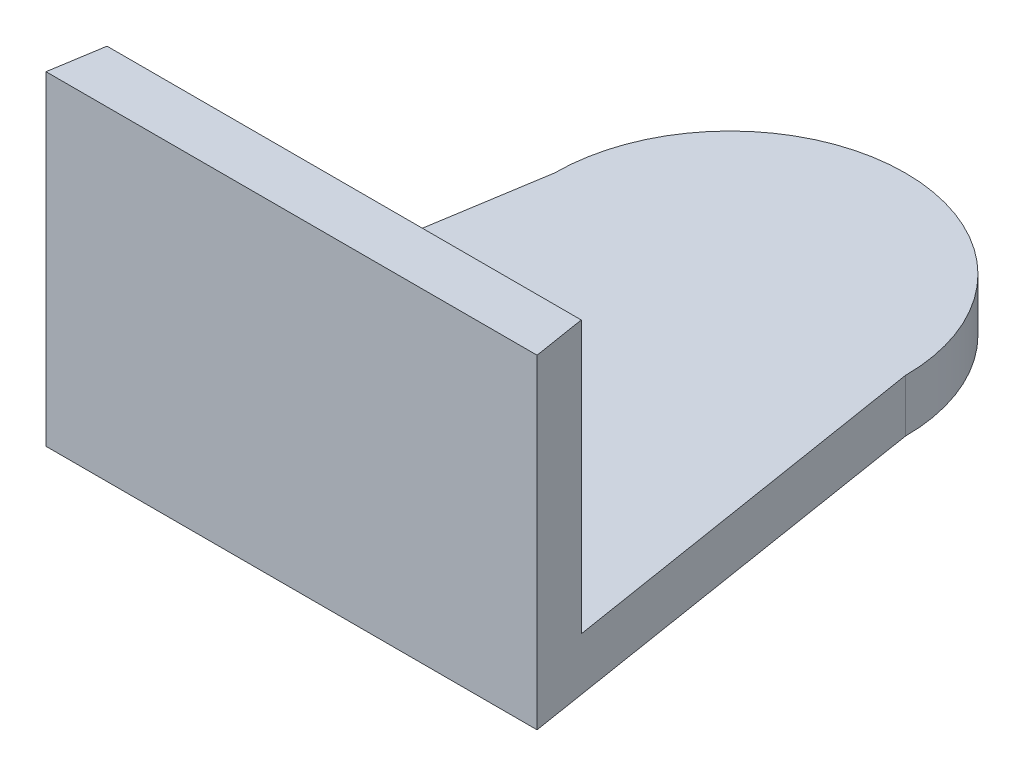
ISO-10303-21;
HEADER;
FILE_DESCRIPTION(('STEP AP214'),'2;1');
FILE_NAME('part.step','',(''),(''),'','','');
FILE_SCHEMA(('AUTOMOTIVE_DESIGN { 1 0 10303 214 1 1 1 1 }'));
ENDSEC;
DATA;
#1=APPLICATION_CONTEXT('core data for automotive mechanical design processes');
#2=APPLICATION_PROTOCOL_DEFINITION('international standard','automotive_design',2000,#1);
#3=PRODUCT_CONTEXT('',#1,'mechanical');
#4=PRODUCT('Part','Part','',(#3));
#5=PRODUCT_RELATED_PRODUCT_CATEGORY('part','',(#4));
#6=PRODUCT_DEFINITION_FORMATION('','',#4);
#7=PRODUCT_DEFINITION_CONTEXT('part definition',#1,'design');
#8=PRODUCT_DEFINITION('design','',#6,#7);
#9=PRODUCT_DEFINITION_SHAPE('','',#8);
#10=(LENGTH_UNIT() NAMED_UNIT(*) SI_UNIT(.MILLI.,.METRE.));
#11=(NAMED_UNIT(*) PLANE_ANGLE_UNIT() SI_UNIT($,.RADIAN.));
#12=(NAMED_UNIT(*) SI_UNIT($,.STERADIAN.) SOLID_ANGLE_UNIT());
#13=UNCERTAINTY_MEASURE_WITH_UNIT(LENGTH_MEASURE(1.E-05),#10,'distance_accuracy_value','');
#14=(GEOMETRIC_REPRESENTATION_CONTEXT(3) GLOBAL_UNCERTAINTY_ASSIGNED_CONTEXT((#13)) GLOBAL_UNIT_ASSIGNED_CONTEXT((#10,
#11,#12)) REPRESENTATION_CONTEXT('',''));
#15=CARTESIAN_POINT('',(0.,0.,0.));
#16=DIRECTION('',(0.,0.,1.));
#17=DIRECTION('',(1.,0.,0.));
#18=AXIS2_PLACEMENT_3D('',#15,#16,#17);
#19=CARTESIAN_POINT('',(0.,3.,0.));
#20=DIRECTION('',(0.,-1.,0.));
#21=DIRECTION('',(0.,0.,-1.));
#22=AXIS2_PLACEMENT_3D('',#19,#20,#21);
#23=PLANE('',#22);
#24=DIRECTION('',(-1.,0.,0.));
#25=VECTOR('',#24,1.);
#26=CARTESIAN_POINT('',(-13.52,3.,22.));
#27=LINE('',#26,#25);
#28=CARTESIAN_POINT('',(13.52,3.,22.));
#29=VERTEX_POINT('',#28);
#30=CARTESIAN_POINT('',(-13.52,3.,22.));
#31=VERTEX_POINT('',#30);
#32=EDGE_CURVE('E52',#29,#31,#27,.T.);
#33=ORIENTED_EDGE('',*,*,#32,.F.);
#34=DIRECTION('',(-0.157990501106673,0.,-0.987440631916705));
#35=VECTOR('',#34,1.);
#36=CARTESIAN_POINT('',(10.,3.,0.));
#37=LINE('',#36,#35);
#38=CARTESIAN_POINT('',(10.,3.,0.));
#39=VERTEX_POINT('',#38);
#40=EDGE_CURVE('E57',#29,#39,#37,.T.);
#41=ORIENTED_EDGE('',*,*,#40,.T.);
#42=CARTESIAN_POINT('',(0.,3.,0.));
#43=DIRECTION('',(0.,1.,0.));
#44=DIRECTION('',(0.,0.,-1.));
#45=AXIS2_PLACEMENT_3D('',#42,#43,#44);
#46=CIRCLE('',#45,10.);
#47=CARTESIAN_POINT('',(-10.,3.,0.));
#48=VERTEX_POINT('',#47);
#49=EDGE_CURVE('E88',#39,#48,#46,.T.);
#50=ORIENTED_EDGE('',*,*,#49,.T.);
#51=DIRECTION('',(-0.157990501106673,0.,0.987440631916705));
#52=VECTOR('',#51,1.);
#53=CARTESIAN_POINT('',(-10.,3.,0.));
#54=LINE('',#53,#52);
#55=EDGE_CURVE('E111',#48,#31,#54,.T.);
#56=ORIENTED_EDGE('',*,*,#55,.T.);
#57=EDGE_LOOP('',(#33,#41,#50,#56));
#58=FACE_BOUND('',#57,.T.);
#59=ADVANCED_FACE('F35',(#58),#23,.F.);
#60=CARTESIAN_POINT('',(0.,3.,0.));
#61=DIRECTION('',(0.,-1.,0.));
#62=DIRECTION('',(0.,0.,-1.));
#63=AXIS2_PLACEMENT_3D('',#60,#61,#62);
#64=CYLINDRICAL_SURFACE('',#63,10.);
#65=CARTESIAN_POINT('',(0.,0.,0.));
#66=DIRECTION('',(0.,1.,0.));
#67=DIRECTION('',(0.,0.,-1.));
#68=AXIS2_PLACEMENT_3D('',#65,#66,#67);
#69=CIRCLE('',#68,10.);
#70=CARTESIAN_POINT('',(10.,0.,0.));
#71=VERTEX_POINT('',#70);
#72=CARTESIAN_POINT('',(-10.,0.,0.));
#73=VERTEX_POINT('',#72);
#74=EDGE_CURVE('E94',#71,#73,#69,.T.);
#75=ORIENTED_EDGE('',*,*,#74,.T.);
#76=DIRECTION('',(0.,-1.,0.));
#77=VECTOR('',#76,1.);
#78=CARTESIAN_POINT('',(-10.,3.,0.));
#79=LINE('',#78,#77);
#80=EDGE_CURVE('E11',#48,#73,#79,.T.);
#81=ORIENTED_EDGE('',*,*,#80,.F.);
#82=ORIENTED_EDGE('',*,*,#49,.F.);
#83=DIRECTION('',(0.,-1.,0.));
#84=VECTOR('',#83,1.);
#85=CARTESIAN_POINT('',(10.,3.,0.));
#86=LINE('',#85,#84);
#87=EDGE_CURVE('E80',#39,#71,#86,.T.);
#88=ORIENTED_EDGE('',*,*,#87,.T.);
#89=EDGE_LOOP('',(#75,#81,#82,#88));
#90=FACE_BOUND('',#89,.T.);
#91=ADVANCED_FACE('F37',(#90),#64,.T.);
#92=CARTESIAN_POINT('',(-10.,3.,0.));
#93=DIRECTION('',(0.987440631916705,0.,0.157990501106673));
#94=DIRECTION('',(0.157990501106673,0.,-0.987440631916705));
#95=AXIS2_PLACEMENT_3D('',#92,#93,#94);
#96=PLANE('',#95);
#97=DIRECTION('',(-0.157990501106673,0.,0.987440631916705));
#98=VECTOR('',#97,1.);
#99=CARTESIAN_POINT('',(-10.,0.,0.));
#100=LINE('',#99,#98);
#101=CARTESIAN_POINT('',(-14.,0.,25.));
#102=VERTEX_POINT('',#101);
#103=EDGE_CURVE('E97',#73,#102,#100,.T.);
#104=ORIENTED_EDGE('',*,*,#103,.T.);
#105=DIRECTION('',(0.,-1.,0.));
#106=VECTOR('',#105,1.);
#107=CARTESIAN_POINT('',(-14.,3.,25.));
#108=LINE('',#107,#106);
#109=CARTESIAN_POINT('',(-14.,18.5,25.));
#110=VERTEX_POINT('',#109);
#111=EDGE_CURVE('E44',#110,#102,#108,.T.);
#112=ORIENTED_EDGE('',*,*,#111,.F.);
#113=DIRECTION('',(-0.157990501106673,0.,0.987440631916705));
#114=VECTOR('',#113,1.);
#115=CARTESIAN_POINT('',(-13.52,18.5,22.));
#116=LINE('',#115,#114);
#117=CARTESIAN_POINT('',(-13.52,18.5,22.));
#118=VERTEX_POINT('',#117);
#119=EDGE_CURVE('E122',#118,#110,#116,.T.);
#120=ORIENTED_EDGE('',*,*,#119,.F.);
#121=DIRECTION('',(0.,-1.,0.));
#122=VECTOR('',#121,1.);
#123=CARTESIAN_POINT('',(-13.52,18.5,22.));
#124=LINE('',#123,#122);
#125=EDGE_CURVE('E102',#118,#31,#124,.T.);
#126=ORIENTED_EDGE('',*,*,#125,.T.);
#127=ORIENTED_EDGE('',*,*,#55,.F.);
#128=ORIENTED_EDGE('',*,*,#80,.T.);
#129=EDGE_LOOP('',(#104,#112,#120,#126,#127,#128));
#130=FACE_BOUND('',#129,.T.);
#131=ADVANCED_FACE('F148',(#130),#96,.F.);
#132=CARTESIAN_POINT('',(-14.,3.,25.));
#133=DIRECTION('',(0.,0.,-1.));
#134=DIRECTION('',(-1.,0.,0.));
#135=AXIS2_PLACEMENT_3D('',#132,#133,#134);
#136=PLANE('',#135);
#137=DIRECTION('',(1.,0.,0.));
#138=VECTOR('',#137,1.);
#139=CARTESIAN_POINT('',(-14.,0.,25.));
#140=LINE('',#139,#138);
#141=CARTESIAN_POINT('',(14.,0.,25.));
#142=VERTEX_POINT('',#141);
#143=EDGE_CURVE('E89',#102,#142,#140,.T.);
#144=ORIENTED_EDGE('',*,*,#143,.T.);
#145=DIRECTION('',(0.,-1.,0.));
#146=VECTOR('',#145,1.);
#147=CARTESIAN_POINT('',(14.,3.,25.));
#148=LINE('',#147,#146);
#149=CARTESIAN_POINT('',(14.,18.5,25.));
#150=VERTEX_POINT('',#149);
#151=EDGE_CURVE('E84',#150,#142,#148,.T.);
#152=ORIENTED_EDGE('',*,*,#151,.F.);
#153=DIRECTION('',(1.,0.,0.));
#154=VECTOR('',#153,1.);
#155=CARTESIAN_POINT('',(-14.,18.5,25.));
#156=LINE('',#155,#154);
#157=EDGE_CURVE('E136',#110,#150,#156,.T.);
#158=ORIENTED_EDGE('',*,*,#157,.F.);
#159=ORIENTED_EDGE('',*,*,#111,.T.);
#160=EDGE_LOOP('',(#144,#152,#158,#159));
#161=FACE_BOUND('',#160,.T.);
#162=ADVANCED_FACE('F155',(#161),#136,.F.);
#163=CARTESIAN_POINT('',(10.,3.,0.));
#164=DIRECTION('',(-0.987440631916705,0.,0.157990501106673));
#165=DIRECTION('',(0.157990501106673,0.,0.987440631916705));
#166=AXIS2_PLACEMENT_3D('',#163,#164,#165);
#167=PLANE('',#166);
#168=DIRECTION('',(-0.157990501106673,0.,-0.987440631916705));
#169=VECTOR('',#168,1.);
#170=CARTESIAN_POINT('',(10.,0.,0.));
#171=LINE('',#170,#169);
#172=EDGE_CURVE('E77',#142,#71,#171,.T.);
#173=ORIENTED_EDGE('',*,*,#172,.T.);
#174=ORIENTED_EDGE('',*,*,#87,.F.);
#175=ORIENTED_EDGE('',*,*,#40,.F.);
#176=DIRECTION('',(0.,-1.,0.));
#177=VECTOR('',#176,1.);
#178=CARTESIAN_POINT('',(13.52,18.5,22.));
#179=LINE('',#178,#177);
#180=CARTESIAN_POINT('',(13.52,18.5,22.));
#181=VERTEX_POINT('',#180);
#182=EDGE_CURVE('E98',#181,#29,#179,.T.);
#183=ORIENTED_EDGE('',*,*,#182,.F.);
#184=DIRECTION('',(-0.157990501106673,0.,-0.987440631916705));
#185=VECTOR('',#184,1.);
#186=CARTESIAN_POINT('',(14.,18.5,25.));
#187=LINE('',#186,#185);
#188=EDGE_CURVE('E131',#150,#181,#187,.T.);
#189=ORIENTED_EDGE('',*,*,#188,.F.);
#190=ORIENTED_EDGE('',*,*,#151,.T.);
#191=EDGE_LOOP('',(#173,#174,#175,#183,#189,#190));
#192=FACE_BOUND('',#191,.T.);
#193=ADVANCED_FACE('F79',(#192),#167,.F.);
#194=CARTESIAN_POINT('',(0.,0.,0.));
#195=DIRECTION('',(0.,-1.,0.));
#196=DIRECTION('',(0.,0.,-1.));
#197=AXIS2_PLACEMENT_3D('',#194,#195,#196);
#198=PLANE('',#197);
#199=ORIENTED_EDGE('',*,*,#74,.F.);
#200=ORIENTED_EDGE('',*,*,#172,.F.);
#201=ORIENTED_EDGE('',*,*,#143,.F.);
#202=ORIENTED_EDGE('',*,*,#103,.F.);
#203=EDGE_LOOP('',(#199,#200,#201,#202));
#204=FACE_BOUND('',#203,.T.);
#205=ADVANCED_FACE('F96',(#204),#198,.T.);
#206=CARTESIAN_POINT('',(-13.52,18.5,22.));
#207=DIRECTION('',(0.,0.,1.));
#208=DIRECTION('',(1.,0.,0.));
#209=AXIS2_PLACEMENT_3D('',#206,#207,#208);
#210=PLANE('',#209);
#211=ORIENTED_EDGE('',*,*,#32,.T.);
#212=ORIENTED_EDGE('',*,*,#125,.F.);
#213=DIRECTION('',(-1.,0.,0.));
#214=VECTOR('',#213,1.);
#215=CARTESIAN_POINT('',(-13.52,18.5,22.));
#216=LINE('',#215,#214);
#217=EDGE_CURVE('E119',#181,#118,#216,.T.);
#218=ORIENTED_EDGE('',*,*,#217,.F.);
#219=ORIENTED_EDGE('',*,*,#182,.T.);
#220=EDGE_LOOP('',(#211,#212,#218,#219));
#221=FACE_BOUND('',#220,.T.);
#222=ADVANCED_FACE('F153',(#221),#210,.F.);
#223=CARTESIAN_POINT('',(0.,18.5,0.));
#224=DIRECTION('',(0.,1.,0.));
#225=DIRECTION('',(0.,0.,1.));
#226=AXIS2_PLACEMENT_3D('',#223,#224,#225);
#227=PLANE('',#226);
#228=ORIENTED_EDGE('',*,*,#119,.T.);
#229=ORIENTED_EDGE('',*,*,#157,.T.);
#230=ORIENTED_EDGE('',*,*,#188,.T.);
#231=ORIENTED_EDGE('',*,*,#217,.T.);
#232=EDGE_LOOP('',(#228,#229,#230,#231));
#233=FACE_BOUND('',#232,.T.);
#234=ADVANCED_FACE('F143',(#233),#227,.T.);
#235=CLOSED_SHELL('',(#59,#91,#131,#162,#193,#205,#222,#234));
#236=MANIFOLD_SOLID_BREP('B2',#235);
#237=ADVANCED_BREP_SHAPE_REPRESENTATION('',(#18,#236),#14);
#238=SHAPE_DEFINITION_REPRESENTATION(#9,#237);
ENDSEC;
END-ISO-10303-21;
